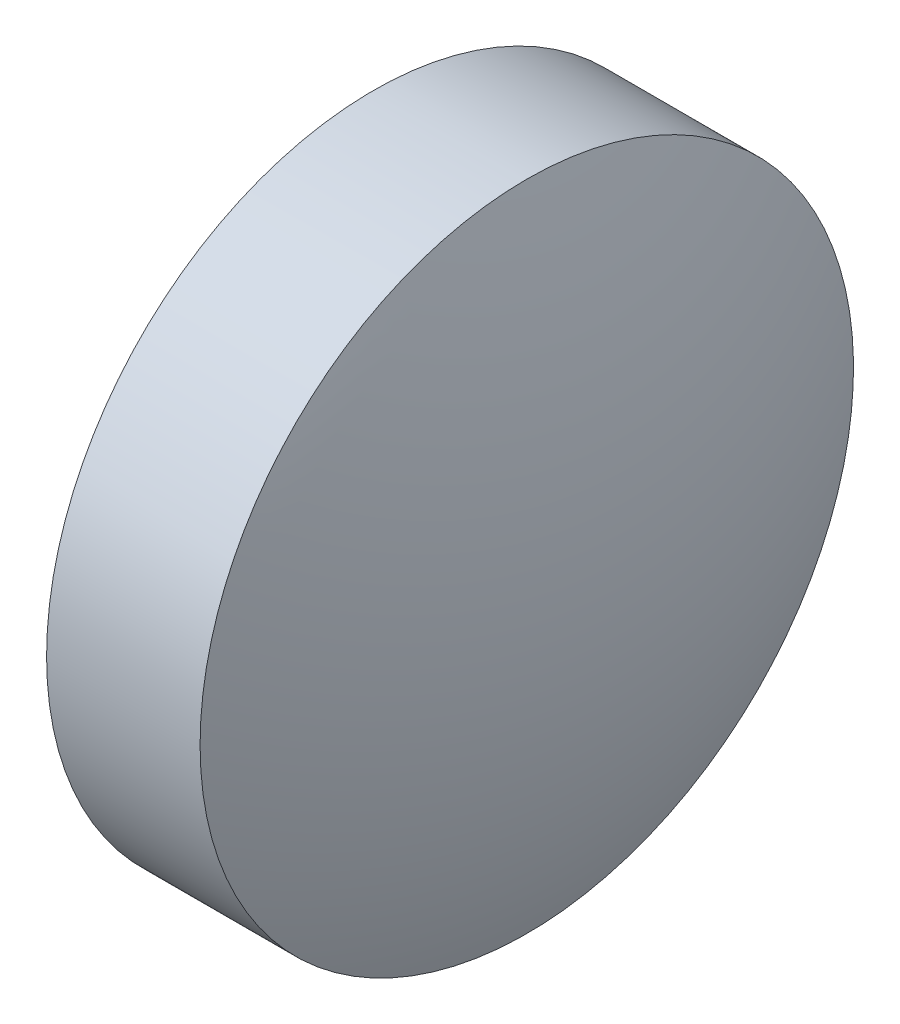
ISO-10303-21;
HEADER;
FILE_DESCRIPTION(('STEP AP214'),'2;1');
FILE_NAME('part.step','',(''),(''),'','','');
FILE_SCHEMA(('AUTOMOTIVE_DESIGN { 1 0 10303 214 1 1 1 1 }'));
ENDSEC;
DATA;
#1=APPLICATION_CONTEXT('core data for automotive mechanical design processes');
#2=APPLICATION_PROTOCOL_DEFINITION('international standard','automotive_design',2000,#1);
#3=PRODUCT_CONTEXT('',#1,'mechanical');
#4=PRODUCT('Part','Part','',(#3));
#5=PRODUCT_RELATED_PRODUCT_CATEGORY('part','',(#4));
#6=PRODUCT_DEFINITION_FORMATION('','',#4);
#7=PRODUCT_DEFINITION_CONTEXT('part definition',#1,'design');
#8=PRODUCT_DEFINITION('design','',#6,#7);
#9=PRODUCT_DEFINITION_SHAPE('','',#8);
#10=(LENGTH_UNIT() NAMED_UNIT(*) SI_UNIT(.MILLI.,.METRE.));
#11=(NAMED_UNIT(*) PLANE_ANGLE_UNIT() SI_UNIT($,.RADIAN.));
#12=(NAMED_UNIT(*) SI_UNIT($,.STERADIAN.) SOLID_ANGLE_UNIT());
#13=UNCERTAINTY_MEASURE_WITH_UNIT(LENGTH_MEASURE(1.E-05),#10,'distance_accuracy_value','');
#14=(GEOMETRIC_REPRESENTATION_CONTEXT(3) GLOBAL_UNCERTAINTY_ASSIGNED_CONTEXT((#13)) GLOBAL_UNIT_ASSIGNED_CONTEXT((#10,
#11,#12)) REPRESENTATION_CONTEXT('',''));
#15=CARTESIAN_POINT('',(0.,0.,0.));
#16=DIRECTION('',(0.,0.,1.));
#17=DIRECTION('',(1.,0.,0.));
#18=AXIS2_PLACEMENT_3D('',#15,#16,#17);
#19=CARTESIAN_POINT('',(16.382726906641,13.0041890759925,0.));
#20=DIRECTION('',(-1.,0.,0.));
#21=DIRECTION('',(0.,1.,0.));
#22=AXIS2_PLACEMENT_3D('',#19,#20,#21);
#23=SPHERICAL_SURFACE('',#22,8.31201612903227);
#24=CARTESIAN_POINT('',(24.0747430356732,13.0041890759925,0.));
#25=DIRECTION('',(-1.,0.,0.));
#26=DIRECTION('',(0.,0.,1.));
#27=AXIS2_PLACEMENT_3D('',#24,#25,#26);
#28=CIRCLE('',#27,3.15);
#29=CARTESIAN_POINT('',(24.0747430356732,13.0041890759925,3.15));
#30=VERTEX_POINT('',#29);
#31=EDGE_CURVE('E10',#30,#30,#28,.T.);
#32=ORIENTED_EDGE('',*,*,#31,.F.);
#33=EDGE_LOOP('',(#32));
#34=FACE_BOUND('',#33,.T.);
#35=ADVANCED_FACE('F35',(#34),#23,.T.);
#36=CARTESIAN_POINT('',(21.7331148660887,13.0041890759925,0.));
#37=DIRECTION('',(-1.,0.,0.));
#38=DIRECTION('',(0.,0.,1.));
#39=AXIS2_PLACEMENT_3D('',#36,#37,#38);
#40=CYLINDRICAL_SURFACE('',#39,3.15);
#41=CARTESIAN_POINT('',(22.5947430356732,13.0041890759925,0.));
#42=DIRECTION('',(-1.,0.,0.));
#43=DIRECTION('',(0.,0.,1.));
#44=AXIS2_PLACEMENT_3D('',#41,#42,#43);
#45=CIRCLE('',#44,3.15);
#46=CARTESIAN_POINT('',(22.5947430356732,13.0041890759925,3.15));
#47=VERTEX_POINT('',#46);
#48=EDGE_CURVE('E41',#47,#47,#45,.T.);
#49=ORIENTED_EDGE('',*,*,#48,.F.);
#50=EDGE_LOOP('',(#49));
#51=FACE_BOUND('',#50,.T.);
#52=ORIENTED_EDGE('',*,*,#31,.T.);
#53=EDGE_LOOP('',(#52));
#54=FACE_BOUND('',#53,.T.);
#55=ADVANCED_FACE('F49',(#51,#54),#40,.T.);
#56=CARTESIAN_POINT('',(22.5947430356732,13.0041890759925,0.));
#57=DIRECTION('',(1.,0.,0.));
#58=DIRECTION('',(0.,0.,-1.));
#59=AXIS2_PLACEMENT_3D('',#56,#57,#58);
#60=PLANE('',#59);
#61=ORIENTED_EDGE('',*,*,#48,.T.);
#62=EDGE_LOOP('',(#61));
#63=FACE_BOUND('',#62,.T.);
#64=ADVANCED_FACE('F47',(#63),#60,.F.);
#65=CLOSED_SHELL('',(#35,#55,#64));
#66=MANIFOLD_SOLID_BREP('B2',#65);
#67=ADVANCED_BREP_SHAPE_REPRESENTATION('',(#18,#66),#14);
#68=SHAPE_DEFINITION_REPRESENTATION(#9,#67);
ENDSEC;
END-ISO-10303-21;
